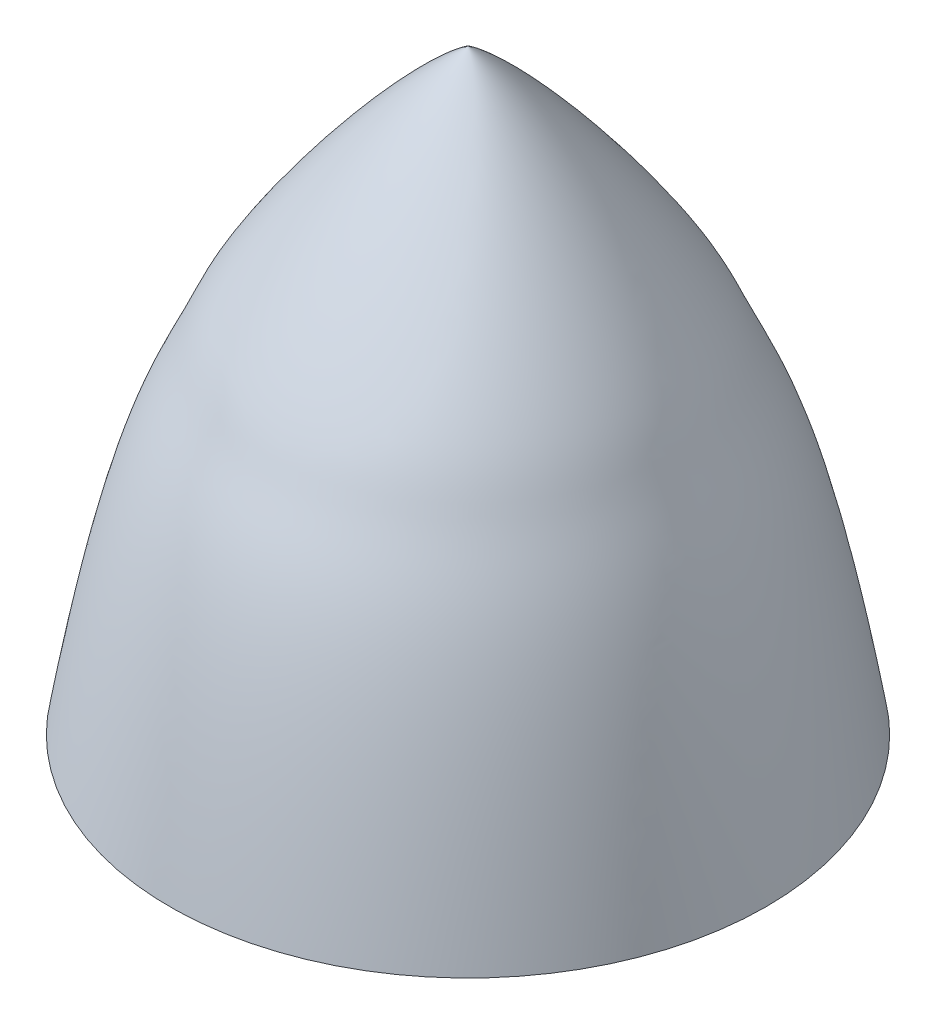
ISO-10303-21;
HEADER;
FILE_DESCRIPTION(('STEP AP214'),'2;1');
FILE_NAME('part.step','',(''),(''),'','','');
FILE_SCHEMA(('AUTOMOTIVE_DESIGN { 1 0 10303 214 1 1 1 1 }'));
ENDSEC;
DATA;
#1=APPLICATION_CONTEXT('core data for automotive mechanical design processes');
#2=APPLICATION_PROTOCOL_DEFINITION('international standard','automotive_design',2000,#1);
#3=PRODUCT_CONTEXT('',#1,'mechanical');
#4=PRODUCT('Part','Part','',(#3));
#5=PRODUCT_RELATED_PRODUCT_CATEGORY('part','',(#4));
#6=PRODUCT_DEFINITION_FORMATION('','',#4);
#7=PRODUCT_DEFINITION_CONTEXT('part definition',#1,'design');
#8=PRODUCT_DEFINITION('design','',#6,#7);
#9=PRODUCT_DEFINITION_SHAPE('','',#8);
#10=(LENGTH_UNIT() NAMED_UNIT(*) SI_UNIT(.MILLI.,.METRE.));
#11=(NAMED_UNIT(*) PLANE_ANGLE_UNIT() SI_UNIT($,.RADIAN.));
#12=(NAMED_UNIT(*) SI_UNIT($,.STERADIAN.) SOLID_ANGLE_UNIT());
#13=UNCERTAINTY_MEASURE_WITH_UNIT(LENGTH_MEASURE(1.E-05),#10,'distance_accuracy_value','');
#14=(GEOMETRIC_REPRESENTATION_CONTEXT(3) GLOBAL_UNCERTAINTY_ASSIGNED_CONTEXT((#13)) GLOBAL_UNIT_ASSIGNED_CONTEXT((#10,
#11,#12)) REPRESENTATION_CONTEXT('',''));
#15=CARTESIAN_POINT('',(0.,0.,0.));
#16=DIRECTION('',(0.,0.,1.));
#17=DIRECTION('',(1.,0.,0.));
#18=AXIS2_PLACEMENT_3D('',#15,#16,#17);
#19=CARTESIAN_POINT('',(0.,0.,0.));
#20=DIRECTION('',(0.,-1.,0.));
#21=DIRECTION('',(0.,0.,-1.));
#22=AXIS2_PLACEMENT_3D('',#19,#20,#21);
#23=PLANE('',#22);
#24=CARTESIAN_POINT('',(0.,0.,0.));
#25=DIRECTION('',(0.,-1.,0.));
#26=DIRECTION('',(0.,0.,-1.));
#27=AXIS2_PLACEMENT_3D('',#24,#25,#26);
#28=CIRCLE('',#27,9.50000000000001);
#29=CARTESIAN_POINT('',(0.,0.,-9.50000000000001));
#30=VERTEX_POINT('',#29);
#31=EDGE_CURVE('E11',#30,#30,#28,.T.);
#32=ORIENTED_EDGE('',*,*,#31,.T.);
#33=EDGE_LOOP('',(#32));
#34=FACE_BOUND('',#33,.T.);
#35=ADVANCED_FACE('F43',(#34),#23,.T.);
#36=CARTESIAN_POINT('',(9.50000000000001,0.,0.));
#37=CARTESIAN_POINT('',(8.23791620910725,7.54191534254579,0.));
#38=CARTESIAN_POINT('',(7.26657442430986,8.90709957250358,0.));
#39=CARTESIAN_POINT('',(5.58523201666274,12.9728491377237,0.));
#40=CARTESIAN_POINT('',(1.87789733748012,17.6850821283125,0.));
#41=CARTESIAN_POINT('',(0.,19.,0.));
#42=B_SPLINE_CURVE_WITH_KNOTS('',3,(#36,#37,#38,#39,#40,#41),.UNSPECIFIED.,.F.,.F.,(4,1,1,4),
(0.,0.497900714505427,0.597900714505427,1.),.UNSPECIFIED.);
#43=CARTESIAN_POINT('',(0.,0.,0.));
#44=DIRECTION('',(0.,-1.,0.));
#45=AXIS1_PLACEMENT('',#43,#44);
#46=SURFACE_OF_REVOLUTION('',#42,#45);
#47=CARTESIAN_POINT('',(0.,19.,0.));
#48=VERTEX_POINT('',#47);
#49=VERTEX_LOOP('',#48);
#50=FACE_BOUND('',#49,.T.);
#51=ORIENTED_EDGE('',*,*,#31,.F.);
#52=EDGE_LOOP('',(#51));
#53=FACE_BOUND('',#52,.T.);
#54=ADVANCED_FACE('F52',(#50,#53),#46,.F.);
#55=CLOSED_SHELL('',(#35,#54));
#56=MANIFOLD_SOLID_BREP('B2',#55);
#57=ADVANCED_BREP_SHAPE_REPRESENTATION('',(#18,#56),#14);
#58=SHAPE_DEFINITION_REPRESENTATION(#9,#57);
ENDSEC;
END-ISO-10303-21;
